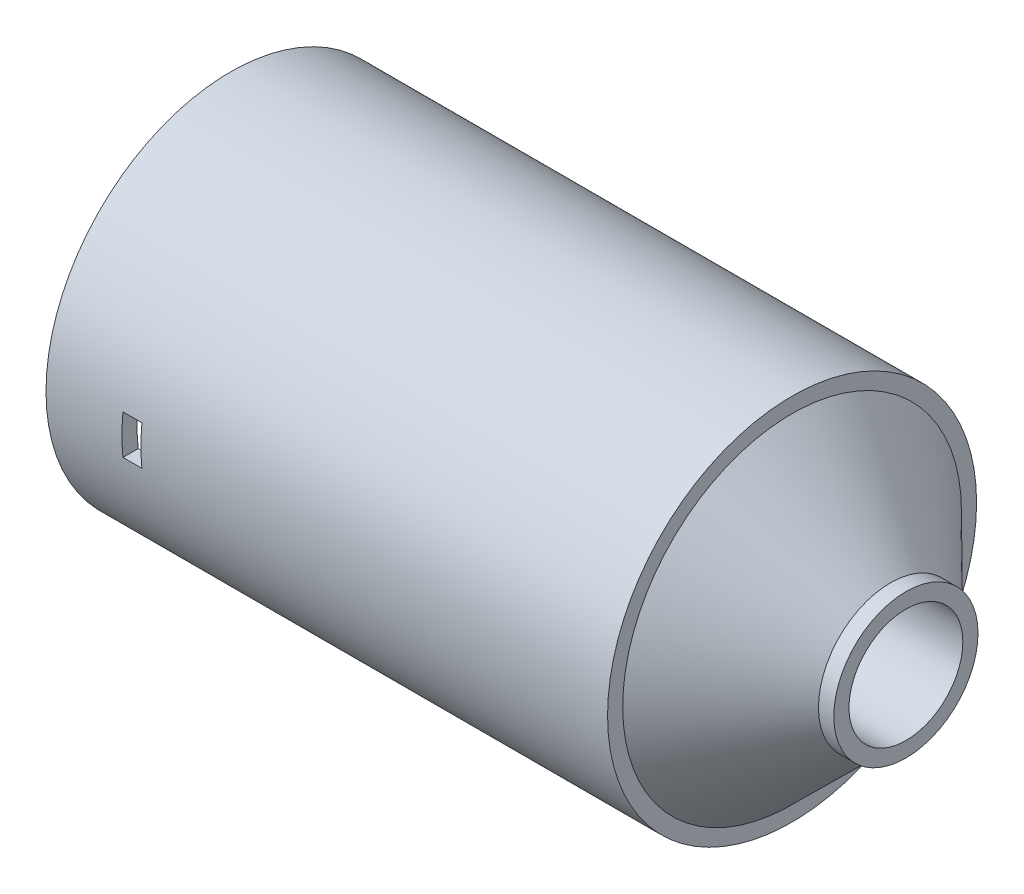
ISO-10303-21;
HEADER;
FILE_DESCRIPTION(('STEP AP214'),'2;1');
FILE_NAME('part.step','',(''),(''),'','','');
FILE_SCHEMA(('AUTOMOTIVE_DESIGN { 1 0 10303 214 1 1 1 1 }'));
ENDSEC;
DATA;
#1=APPLICATION_CONTEXT('core data for automotive mechanical design processes');
#2=APPLICATION_PROTOCOL_DEFINITION('international standard','automotive_design',2000,#1);
#3=PRODUCT_CONTEXT('',#1,'mechanical');
#4=PRODUCT('Part','Part','',(#3));
#5=PRODUCT_RELATED_PRODUCT_CATEGORY('part','',(#4));
#6=PRODUCT_DEFINITION_FORMATION('','',#4);
#7=PRODUCT_DEFINITION_CONTEXT('part definition',#1,'design');
#8=PRODUCT_DEFINITION('design','',#6,#7);
#9=PRODUCT_DEFINITION_SHAPE('','',#8);
#10=(LENGTH_UNIT() NAMED_UNIT(*) SI_UNIT(.MILLI.,.METRE.));
#11=(NAMED_UNIT(*) PLANE_ANGLE_UNIT() SI_UNIT($,.RADIAN.));
#12=(NAMED_UNIT(*) SI_UNIT($,.STERADIAN.) SOLID_ANGLE_UNIT());
#13=UNCERTAINTY_MEASURE_WITH_UNIT(LENGTH_MEASURE(1.E-05),#10,'distance_accuracy_value','');
#14=(GEOMETRIC_REPRESENTATION_CONTEXT(3) GLOBAL_UNCERTAINTY_ASSIGNED_CONTEXT((#13)) GLOBAL_UNIT_ASSIGNED_CONTEXT((#10,
#11,#12)) REPRESENTATION_CONTEXT('',''));
#15=CARTESIAN_POINT('',(0.,0.,0.));
#16=DIRECTION('',(0.,0.,1.));
#17=DIRECTION('',(1.,0.,0.));
#18=AXIS2_PLACEMENT_3D('',#15,#16,#17);
#19=CARTESIAN_POINT('',(79.,0.,0.));
#20=DIRECTION('',(-1.,0.,0.));
#21=DIRECTION('',(0.,0.,1.));
#22=AXIS2_PLACEMENT_3D('',#19,#20,#21);
#23=CONICAL_SURFACE('',#22,7.5,0.779277673042684);
#24=CARTESIAN_POINT('',(64.,0.,0.));
#25=DIRECTION('',(1.,0.,0.));
#26=DIRECTION('',(0.,0.,-1.));
#27=AXIS2_PLACEMENT_3D('',#24,#25,#26);
#28=CIRCLE('',#27,22.3175);
#29=CARTESIAN_POINT('',(64.,0.,-22.3175));
#30=VERTEX_POINT('',#29);
#31=EDGE_CURVE('E65',#30,#30,#28,.T.);
#32=ORIENTED_EDGE('',*,*,#31,.T.);
#33=EDGE_LOOP('',(#32));
#34=FACE_BOUND('',#33,.T.);
#35=CARTESIAN_POINT('',(76.9753669647376,0.,0.));
#36=DIRECTION('',(-1.,0.,0.));
#37=DIRECTION('',(0.,0.,1.));
#38=AXIS2_PLACEMENT_3D('',#35,#36,#37);
#39=CIRCLE('',#38,9.5);
#40=CARTESIAN_POINT('',(76.9753669647376,0.,9.5));
#41=VERTEX_POINT('',#40);
#42=EDGE_CURVE('E61',#41,#41,#39,.F.);
#43=ORIENTED_EDGE('',*,*,#42,.F.);
#44=EDGE_LOOP('',(#43));
#45=FACE_BOUND('',#44,.T.);
#46=ADVANCED_FACE('F54',(#34,#45),#23,.T.);
#47=CARTESIAN_POINT('',(79.,0.,0.));
#48=DIRECTION('',(1.,0.,0.));
#49=DIRECTION('',(0.,0.,-1.));
#50=AXIS2_PLACEMENT_3D('',#47,#48,#49);
#51=PLANE('',#50);
#52=CARTESIAN_POINT('',(79.,0.,0.));
#53=DIRECTION('',(1.,0.,0.));
#54=DIRECTION('',(0.,0.,-1.));
#55=AXIS2_PLACEMENT_3D('',#52,#53,#54);
#56=CIRCLE('',#55,7.5);
#57=CARTESIAN_POINT('',(79.,0.,-7.5));
#58=VERTEX_POINT('',#57);
#59=EDGE_CURVE('E69',#58,#58,#56,.T.);
#60=ORIENTED_EDGE('',*,*,#59,.F.);
#61=EDGE_LOOP('',(#60));
#62=FACE_BOUND('',#61,.T.);
#63=CARTESIAN_POINT('',(79.,0.,0.));
#64=DIRECTION('',(1.,0.,0.));
#65=DIRECTION('',(0.,0.,-1.));
#66=AXIS2_PLACEMENT_3D('',#63,#64,#65);
#67=CIRCLE('',#66,9.5);
#68=CARTESIAN_POINT('',(79.,0.,-9.5));
#69=VERTEX_POINT('',#68);
#70=EDGE_CURVE('E12',#69,#69,#67,.T.);
#71=ORIENTED_EDGE('',*,*,#70,.T.);
#72=EDGE_LOOP('',(#71));
#73=FACE_BOUND('',#72,.T.);
#74=ADVANCED_FACE('F90',(#62,#73),#51,.T.);
#75=CARTESIAN_POINT('',(79.,0.,0.));
#76=DIRECTION('',(-1.,0.,0.));
#77=DIRECTION('',(0.,0.,1.));
#78=AXIS2_PLACEMENT_3D('',#75,#76,#77);
#79=CYLINDRICAL_SURFACE('',#78,9.5);
#80=ORIENTED_EDGE('',*,*,#42,.T.);
#81=EDGE_LOOP('',(#80));
#82=FACE_BOUND('',#81,.T.);
#83=ORIENTED_EDGE('',*,*,#70,.F.);
#84=EDGE_LOOP('',(#83));
#85=FACE_BOUND('',#84,.T.);
#86=ADVANCED_FACE('F56',(#82,#85),#79,.T.);
#87=CARTESIAN_POINT('',(64.,0.,0.));
#88=DIRECTION('',(1.,0.,0.));
#89=DIRECTION('',(0.,0.,-1.));
#90=AXIS2_PLACEMENT_3D('',#87,#88,#89);
#91=PLANE('',#90);
#92=CARTESIAN_POINT('',(64.,0.,0.));
#93=DIRECTION('',(1.,0.,0.));
#94=DIRECTION('',(0.,0.,-1.));
#95=AXIS2_PLACEMENT_3D('',#92,#93,#94);
#96=CIRCLE('',#95,7.5);
#97=CARTESIAN_POINT('',(64.,0.,-7.5));
#98=VERTEX_POINT('',#97);
#99=EDGE_CURVE('E109',#98,#98,#96,.T.);
#100=ORIENTED_EDGE('',*,*,#99,.T.);
#101=EDGE_LOOP('',(#100));
#102=FACE_BOUND('',#101,.T.);
#103=ORIENTED_EDGE('',*,*,#31,.F.);
#104=EDGE_LOOP('',(#103));
#105=FACE_BOUND('',#104,.T.);
#106=ADVANCED_FACE('F79',(#102,#105),#91,.F.);
#107=CARTESIAN_POINT('',(79.001,0.,0.));
#108=DIRECTION('',(-1.,0.,0.));
#109=DIRECTION('',(0.,0.,1.));
#110=AXIS2_PLACEMENT_3D('',#107,#108,#109);
#111=CYLINDRICAL_SURFACE('',#110,7.5);
#112=ORIENTED_EDGE('',*,*,#59,.T.);
#113=EDGE_LOOP('',(#112));
#114=FACE_BOUND('',#113,.T.);
#115=ORIENTED_EDGE('',*,*,#99,.F.);
#116=EDGE_LOOP('',(#115));
#117=FACE_BOUND('',#116,.T.);
#118=ADVANCED_FACE('F88',(#114,#117),#111,.F.);
#119=CLOSED_SHELL('',(#46,#74,#86,#106,#118));
#120=MANIFOLD_SOLID_BREP('B2',#119);
#121=CARTESIAN_POINT('',(-10.,0.,0.));
#122=DIRECTION('',(1.,0.,0.));
#123=DIRECTION('',(0.,0.,-1.));
#124=AXIS2_PLACEMENT_3D('',#121,#122,#123);
#125=CYLINDRICAL_SURFACE('',#124,24.315);
#126=CARTESIAN_POINT('',(0.,0.,0.));
#127=DIRECTION('',(-1.,0.,0.));
#128=DIRECTION('',(0.,-1.,0.));
#129=AXIS2_PLACEMENT_3D('',#126,#127,#128);
#130=CIRCLE('',#129,24.315);
#131=CARTESIAN_POINT('',(0.,-2.6,-24.1755915129289));
#132=VERTEX_POINT('',#131);
#133=CARTESIAN_POINT('',(0.,2.6,-24.1755915129289));
#134=VERTEX_POINT('',#133);
#135=EDGE_CURVE('E193',#132,#134,#130,.F.);
#136=ORIENTED_EDGE('',*,*,#135,.F.);
#137=DIRECTION('',(1.,0.,0.));
#138=VECTOR('',#137,1.);
#139=CARTESIAN_POINT('',(-10.,-2.6,-24.1755915129289));
#140=LINE('',#139,#138);
#141=CARTESIAN_POINT('',(2.5,-2.6,-24.1755915129289));
#142=VERTEX_POINT('',#141);
#143=EDGE_CURVE('E261',#142,#132,#140,.F.);
#144=ORIENTED_EDGE('',*,*,#143,.F.);
#145=CARTESIAN_POINT('',(2.5,0.,0.));
#146=DIRECTION('',(1.,0.,0.));
#147=DIRECTION('',(0.,0.,-1.));
#148=AXIS2_PLACEMENT_3D('',#145,#146,#147);
#149=CIRCLE('',#148,24.315);
#150=CARTESIAN_POINT('',(2.5,2.6,-24.1755915129289));
#151=VERTEX_POINT('',#150);
#152=EDGE_CURVE('E246',#151,#142,#149,.F.);
#153=ORIENTED_EDGE('',*,*,#152,.F.);
#154=DIRECTION('',(1.,0.,0.));
#155=VECTOR('',#154,1.);
#156=CARTESIAN_POINT('',(-10.,2.6,-24.1755915129289));
#157=LINE('',#156,#155);
#158=EDGE_CURVE('E247',#134,#151,#157,.T.);
#159=ORIENTED_EDGE('',*,*,#158,.F.);
#160=EDGE_LOOP('',(#136,#144,#153,#159));
#161=FACE_BOUND('',#160,.T.);
#162=CARTESIAN_POINT('',(2.5,-2.6,24.1755915129289));
#163=VERTEX_POINT('',#162);
#164=CARTESIAN_POINT('',(2.5,2.6,24.1755915129289));
#165=VERTEX_POINT('',#164);
#166=EDGE_CURVE('E185',#163,#165,#149,.F.);
#167=ORIENTED_EDGE('',*,*,#166,.F.);
#168=DIRECTION('',(1.,0.,0.));
#169=VECTOR('',#168,1.);
#170=CARTESIAN_POINT('',(-10.,-2.6,24.1755915129289));
#171=LINE('',#170,#169);
#172=CARTESIAN_POINT('',(0.,-2.6,24.1755915129289));
#173=VERTEX_POINT('',#172);
#174=EDGE_CURVE('E260',#173,#163,#171,.T.);
#175=ORIENTED_EDGE('',*,*,#174,.F.);
#176=CARTESIAN_POINT('',(0.,2.6,24.1755915129289));
#177=VERTEX_POINT('',#176);
#178=EDGE_CURVE('E252',#177,#173,#130,.F.);
#179=ORIENTED_EDGE('',*,*,#178,.F.);
#180=DIRECTION('',(1.,0.,0.));
#181=VECTOR('',#180,1.);
#182=CARTESIAN_POINT('',(-10.,2.6,24.1755915129289));
#183=LINE('',#182,#181);
#184=EDGE_CURVE('E238',#165,#177,#183,.F.);
#185=ORIENTED_EDGE('',*,*,#184,.F.);
#186=EDGE_LOOP('',(#167,#175,#179,#185));
#187=FACE_BOUND('',#186,.T.);
#188=CARTESIAN_POINT('',(-10.,0.,0.));
#189=DIRECTION('',(1.,0.,0.));
#190=DIRECTION('',(0.,0.,-1.));
#191=AXIS2_PLACEMENT_3D('',#188,#189,#190);
#192=CIRCLE('',#191,24.315);
#193=CARTESIAN_POINT('',(-10.,0.,-24.315));
#194=VERTEX_POINT('',#193);
#195=EDGE_CURVE('E275',#194,#194,#192,.T.);
#196=ORIENTED_EDGE('',*,*,#195,.T.);
#197=EDGE_LOOP('',(#196));
#198=FACE_BOUND('',#197,.T.);
#199=CARTESIAN_POINT('',(64.,0.,0.));
#200=DIRECTION('',(1.,0.,0.));
#201=DIRECTION('',(0.,0.,-1.));
#202=AXIS2_PLACEMENT_3D('',#199,#200,#201);
#203=CIRCLE('',#202,24.315);
#204=CARTESIAN_POINT('',(64.,0.,-24.315));
#205=VERTEX_POINT('',#204);
#206=EDGE_CURVE('E269',#205,#205,#203,.T.);
#207=ORIENTED_EDGE('',*,*,#206,.F.);
#208=EDGE_LOOP('',(#207));
#209=FACE_BOUND('',#208,.T.);
#210=ADVANCED_FACE('F169',(#161,#187,#198,#209),#125,.T.);
#211=CARTESIAN_POINT('',(-10.,0.,0.));
#212=DIRECTION('',(1.,0.,0.));
#213=DIRECTION('',(0.,0.,-1.));
#214=AXIS2_PLACEMENT_3D('',#211,#212,#213);
#215=PLANE('',#214);
#216=CARTESIAN_POINT('',(-10.,0.,0.));
#217=DIRECTION('',(1.,0.,0.));
#218=DIRECTION('',(0.,0.,-1.));
#219=AXIS2_PLACEMENT_3D('',#216,#217,#218);
#220=CIRCLE('',#219,22.3175);
#221=CARTESIAN_POINT('',(-10.,0.,-22.3175));
#222=VERTEX_POINT('',#221);
#223=EDGE_CURVE('E272',#222,#222,#220,.T.);
#224=ORIENTED_EDGE('',*,*,#223,.T.);
#225=EDGE_LOOP('',(#224));
#226=FACE_BOUND('',#225,.T.);
#227=ORIENTED_EDGE('',*,*,#195,.F.);
#228=EDGE_LOOP('',(#227));
#229=FACE_BOUND('',#228,.T.);
#230=ADVANCED_FACE('F324',(#226,#229),#215,.F.);
#231=CARTESIAN_POINT('',(-10.,0.,0.));
#232=DIRECTION('',(1.,0.,0.));
#233=DIRECTION('',(0.,0.,-1.));
#234=AXIS2_PLACEMENT_3D('',#231,#232,#233);
#235=CYLINDRICAL_SURFACE('',#234,22.3175);
#236=DIRECTION('',(1.,0.,0.));
#237=VECTOR('',#236,1.);
#238=CARTESIAN_POINT('',(-10.,2.6,22.1655319415077));
#239=LINE('',#238,#237);
#240=CARTESIAN_POINT('',(2.5,2.6,22.1655319415077));
#241=VERTEX_POINT('',#240);
#242=CARTESIAN_POINT('',(0.,2.6,22.1655319415077));
#243=VERTEX_POINT('',#242);
#244=EDGE_CURVE('E288',#241,#243,#239,.F.);
#245=ORIENTED_EDGE('',*,*,#244,.T.);
#246=CARTESIAN_POINT('',(0.,0.,0.));
#247=DIRECTION('',(-1.,0.,0.));
#248=DIRECTION('',(0.,-1.,0.));
#249=AXIS2_PLACEMENT_3D('',#246,#247,#248);
#250=CIRCLE('',#249,22.3175);
#251=CARTESIAN_POINT('',(0.,-2.6,22.1655319415077));
#252=VERTEX_POINT('',#251);
#253=EDGE_CURVE('E52',#243,#252,#250,.F.);
#254=ORIENTED_EDGE('',*,*,#253,.T.);
#255=DIRECTION('',(1.,0.,0.));
#256=VECTOR('',#255,1.);
#257=CARTESIAN_POINT('',(-10.,-2.6,22.1655319415077));
#258=LINE('',#257,#256);
#259=CARTESIAN_POINT('',(2.5,-2.6,22.1655319415077));
#260=VERTEX_POINT('',#259);
#261=EDGE_CURVE('E172',#252,#260,#258,.T.);
#262=ORIENTED_EDGE('',*,*,#261,.T.);
#263=CARTESIAN_POINT('',(2.5,0.,0.));
#264=DIRECTION('',(1.,0.,0.));
#265=DIRECTION('',(0.,0.,-1.));
#266=AXIS2_PLACEMENT_3D('',#263,#264,#265);
#267=CIRCLE('',#266,22.3175);
#268=EDGE_CURVE('E285',#260,#241,#267,.F.);
#269=ORIENTED_EDGE('',*,*,#268,.T.);
#270=EDGE_LOOP('',(#245,#254,#262,#269));
#271=FACE_BOUND('',#270,.T.);
#272=DIRECTION('',(1.,0.,0.));
#273=VECTOR('',#272,1.);
#274=CARTESIAN_POINT('',(-10.,-2.6,-22.1655319415077));
#275=LINE('',#274,#273);
#276=CARTESIAN_POINT('',(2.5,-2.6,-22.1655319415077));
#277=VERTEX_POINT('',#276);
#278=CARTESIAN_POINT('',(0.,-2.6,-22.1655319415077));
#279=VERTEX_POINT('',#278);
#280=EDGE_CURVE('E284',#277,#279,#275,.F.);
#281=ORIENTED_EDGE('',*,*,#280,.T.);
#282=CARTESIAN_POINT('',(0.,2.6,-22.1655319415077));
#283=VERTEX_POINT('',#282);
#284=EDGE_CURVE('E178',#279,#283,#250,.F.);
#285=ORIENTED_EDGE('',*,*,#284,.T.);
#286=DIRECTION('',(1.,0.,0.));
#287=VECTOR('',#286,1.);
#288=CARTESIAN_POINT('',(-10.,2.6,-22.1655319415077));
#289=LINE('',#288,#287);
#290=CARTESIAN_POINT('',(2.5,2.6,-22.1655319415077));
#291=VERTEX_POINT('',#290);
#292=EDGE_CURVE('E278',#283,#291,#289,.T.);
#293=ORIENTED_EDGE('',*,*,#292,.T.);
#294=EDGE_CURVE('E281',#291,#277,#267,.F.);
#295=ORIENTED_EDGE('',*,*,#294,.T.);
#296=EDGE_LOOP('',(#281,#285,#293,#295));
#297=FACE_BOUND('',#296,.T.);
#298=ORIENTED_EDGE('',*,*,#223,.F.);
#299=EDGE_LOOP('',(#298));
#300=FACE_BOUND('',#299,.T.);
#301=CARTESIAN_POINT('',(64.,0.,0.));
#302=DIRECTION('',(1.,0.,0.));
#303=DIRECTION('',(0.,0.,-1.));
#304=AXIS2_PLACEMENT_3D('',#301,#302,#303);
#305=CIRCLE('',#304,22.3175);
#306=CARTESIAN_POINT('',(64.,0.,-22.3175));
#307=VERTEX_POINT('',#306);
#308=EDGE_CURVE('E263',#307,#307,#305,.T.);
#309=ORIENTED_EDGE('',*,*,#308,.T.);
#310=EDGE_LOOP('',(#309));
#311=FACE_BOUND('',#310,.T.);
#312=ADVANCED_FACE('F292',(#271,#297,#300,#311),#235,.F.);
#313=CARTESIAN_POINT('',(64.,0.,0.));
#314=DIRECTION('',(1.,0.,0.));
#315=DIRECTION('',(0.,0.,-1.));
#316=AXIS2_PLACEMENT_3D('',#313,#314,#315);
#317=PLANE('',#316);
#318=ORIENTED_EDGE('',*,*,#206,.T.);
#319=EDGE_LOOP('',(#318));
#320=FACE_BOUND('',#319,.T.);
#321=ORIENTED_EDGE('',*,*,#308,.F.);
#322=EDGE_LOOP('',(#321));
#323=FACE_BOUND('',#322,.T.);
#324=ADVANCED_FACE('F350',(#320,#323),#317,.T.);
#325=CARTESIAN_POINT('',(0.,2.6,24.315));
#326=DIRECTION('',(0.,1.,0.));
#327=DIRECTION('',(0.,0.,1.));
#328=AXIS2_PLACEMENT_3D('',#325,#326,#327);
#329=PLANE('',#328);
#330=ORIENTED_EDGE('',*,*,#158,.T.);
#331=DIRECTION('',(0.,0.,-1.));
#332=VECTOR('',#331,1.);
#333=CARTESIAN_POINT('',(2.5,2.6,24.315));
#334=LINE('',#333,#332);
#335=EDGE_CURVE('E255',#291,#151,#334,.T.);
#336=ORIENTED_EDGE('',*,*,#335,.F.);
#337=ORIENTED_EDGE('',*,*,#292,.F.);
#338=DIRECTION('',(0.,0.,-1.));
#339=VECTOR('',#338,1.);
#340=CARTESIAN_POINT('',(0.,2.6,24.315));
#341=LINE('',#340,#339);
#342=EDGE_CURVE('E256',#283,#134,#341,.T.);
#343=ORIENTED_EDGE('',*,*,#342,.T.);
#344=EDGE_LOOP('',(#330,#336,#337,#343));
#345=FACE_BOUND('',#344,.T.);
#346=ADVANCED_FACE('F318',(#345),#329,.F.);
#347=CARTESIAN_POINT('',(2.5,-2.6,24.315));
#348=DIRECTION('',(1.,0.,0.));
#349=DIRECTION('',(0.,0.,-1.));
#350=AXIS2_PLACEMENT_3D('',#347,#348,#349);
#351=PLANE('',#350);
#352=ORIENTED_EDGE('',*,*,#152,.T.);
#353=DIRECTION('',(0.,0.,-1.));
#354=VECTOR('',#353,1.);
#355=CARTESIAN_POINT('',(2.5,-2.6,24.315));
#356=LINE('',#355,#354);
#357=EDGE_CURVE('E304',#277,#142,#356,.T.);
#358=ORIENTED_EDGE('',*,*,#357,.F.);
#359=ORIENTED_EDGE('',*,*,#294,.F.);
#360=ORIENTED_EDGE('',*,*,#335,.T.);
#361=EDGE_LOOP('',(#352,#358,#359,#360));
#362=FACE_BOUND('',#361,.T.);
#363=ADVANCED_FACE('F312',(#362),#351,.F.);
#364=CARTESIAN_POINT('',(0.,-2.6,24.315));
#365=DIRECTION('',(0.,-1.,0.));
#366=DIRECTION('',(1.,0.,0.));
#367=AXIS2_PLACEMENT_3D('',#364,#365,#366);
#368=PLANE('',#367);
#369=ORIENTED_EDGE('',*,*,#143,.T.);
#370=DIRECTION('',(0.,0.,-1.));
#371=VECTOR('',#370,1.);
#372=CARTESIAN_POINT('',(0.,-2.6,24.315));
#373=LINE('',#372,#371);
#374=EDGE_CURVE('E299',#279,#132,#373,.T.);
#375=ORIENTED_EDGE('',*,*,#374,.F.);
#376=ORIENTED_EDGE('',*,*,#280,.F.);
#377=ORIENTED_EDGE('',*,*,#357,.T.);
#378=EDGE_LOOP('',(#369,#375,#376,#377));
#379=FACE_BOUND('',#378,.T.);
#380=ADVANCED_FACE('F320',(#379),#368,.F.);
#381=CARTESIAN_POINT('',(0.,-2.6,24.315));
#382=DIRECTION('',(-1.,0.,0.));
#383=DIRECTION('',(0.,-1.,0.));
#384=AXIS2_PLACEMENT_3D('',#381,#382,#383);
#385=PLANE('',#384);
#386=ORIENTED_EDGE('',*,*,#135,.T.);
#387=ORIENTED_EDGE('',*,*,#342,.F.);
#388=ORIENTED_EDGE('',*,*,#284,.F.);
#389=ORIENTED_EDGE('',*,*,#374,.T.);
#390=EDGE_LOOP('',(#386,#387,#388,#389));
#391=FACE_BOUND('',#390,.T.);
#392=ADVANCED_FACE('F338',(#391),#385,.F.);
#393=ORIENTED_EDGE('',*,*,#178,.T.);
#394=EDGE_CURVE('E297',#173,#252,#373,.T.);
#395=ORIENTED_EDGE('',*,*,#394,.T.);
#396=ORIENTED_EDGE('',*,*,#253,.F.);
#397=EDGE_CURVE('E241',#177,#243,#341,.T.);
#398=ORIENTED_EDGE('',*,*,#397,.F.);
#399=EDGE_LOOP('',(#393,#395,#396,#398));
#400=FACE_BOUND('',#399,.T.);
#401=ADVANCED_FACE('F250',(#400),#385,.F.);
#402=ORIENTED_EDGE('',*,*,#174,.T.);
#403=EDGE_CURVE('E298',#163,#260,#356,.T.);
#404=ORIENTED_EDGE('',*,*,#403,.T.);
#405=ORIENTED_EDGE('',*,*,#261,.F.);
#406=ORIENTED_EDGE('',*,*,#394,.F.);
#407=EDGE_LOOP('',(#402,#404,#405,#406));
#408=FACE_BOUND('',#407,.T.);
#409=ADVANCED_FACE('F296',(#408),#368,.F.);
#410=ORIENTED_EDGE('',*,*,#166,.T.);
#411=EDGE_CURVE('E243',#165,#241,#334,.T.);
#412=ORIENTED_EDGE('',*,*,#411,.T.);
#413=ORIENTED_EDGE('',*,*,#268,.F.);
#414=ORIENTED_EDGE('',*,*,#403,.F.);
#415=EDGE_LOOP('',(#410,#412,#413,#414));
#416=FACE_BOUND('',#415,.T.);
#417=ADVANCED_FACE('F309',(#416),#351,.F.);
#418=ORIENTED_EDGE('',*,*,#184,.T.);
#419=ORIENTED_EDGE('',*,*,#397,.T.);
#420=ORIENTED_EDGE('',*,*,#244,.F.);
#421=ORIENTED_EDGE('',*,*,#411,.F.);
#422=EDGE_LOOP('',(#418,#419,#420,#421));
#423=FACE_BOUND('',#422,.T.);
#424=ADVANCED_FACE('F240',(#423),#329,.F.);
#425=CLOSED_SHELL('',(#210,#230,#312,#324,#346,#363,#380,#392,#401,#409,#417,#424));
#426=MANIFOLD_SOLID_BREP('B7',#425);
#427=ADVANCED_BREP_SHAPE_REPRESENTATION('',(#18,#120,#426),#14);
#428=SHAPE_DEFINITION_REPRESENTATION(#9,#427);
ENDSEC;
END-ISO-10303-21;
